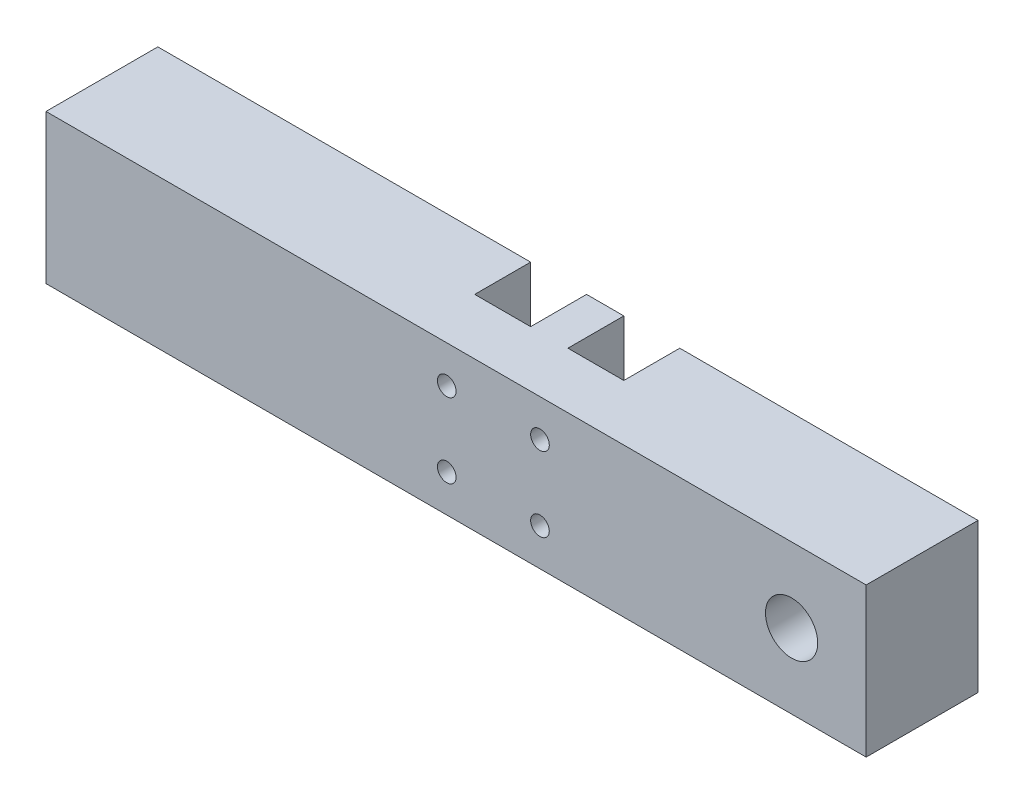
ISO-10303-21;
HEADER;
FILE_DESCRIPTION(('STEP AP214'),'2;1');
FILE_NAME('part.step','',(''),(''),'','','');
FILE_SCHEMA(('AUTOMOTIVE_DESIGN { 1 0 10303 214 1 1 1 1 }'));
ENDSEC;
DATA;
#1=APPLICATION_CONTEXT('core data for automotive mechanical design processes');
#2=APPLICATION_PROTOCOL_DEFINITION('international standard','automotive_design',2000,#1);
#3=PRODUCT_CONTEXT('',#1,'mechanical');
#4=PRODUCT('Part','Part','',(#3));
#5=PRODUCT_RELATED_PRODUCT_CATEGORY('part','',(#4));
#6=PRODUCT_DEFINITION_FORMATION('','',#4);
#7=PRODUCT_DEFINITION_CONTEXT('part definition',#1,'design');
#8=PRODUCT_DEFINITION('design','',#6,#7);
#9=PRODUCT_DEFINITION_SHAPE('','',#8);
#10=(LENGTH_UNIT() NAMED_UNIT(*) SI_UNIT(.MILLI.,.METRE.));
#11=(NAMED_UNIT(*) PLANE_ANGLE_UNIT() SI_UNIT($,.RADIAN.));
#12=(NAMED_UNIT(*) SI_UNIT($,.STERADIAN.) SOLID_ANGLE_UNIT());
#13=UNCERTAINTY_MEASURE_WITH_UNIT(LENGTH_MEASURE(1.E-05),#10,'distance_accuracy_value','');
#14=(GEOMETRIC_REPRESENTATION_CONTEXT(3) GLOBAL_UNCERTAINTY_ASSIGNED_CONTEXT((#13)) GLOBAL_UNIT_ASSIGNED_CONTEXT((#10,
#11,#12)) REPRESENTATION_CONTEXT('',''));
#15=CARTESIAN_POINT('',(0.,0.,0.));
#16=DIRECTION('',(0.,0.,1.));
#17=DIRECTION('',(1.,0.,0.));
#18=AXIS2_PLACEMENT_3D('',#15,#16,#17);
#19=CARTESIAN_POINT('',(0.,0.,0.));
#20=DIRECTION('',(0.,0.,1.));
#21=DIRECTION('',(1.,0.,0.));
#22=AXIS2_PLACEMENT_3D('',#19,#20,#21);
#23=PLANE('',#22);
#24=DIRECTION('',(-1.,0.,0.));
#25=VECTOR('',#24,1.);
#26=CARTESIAN_POINT('',(-110.,20.,0.));
#27=LINE('',#26,#25);
#28=CARTESIAN_POINT('',(-9.99999999999999,20.,0.));
#29=VERTEX_POINT('',#28);
#30=CARTESIAN_POINT('',(-110.,20.,0.));
#31=VERTEX_POINT('',#30);
#32=EDGE_CURVE('E200',#29,#31,#27,.T.);
#33=ORIENTED_EDGE('',*,*,#32,.F.);
#34=DIRECTION('',(0.,1.,0.));
#35=VECTOR('',#34,1.);
#36=CARTESIAN_POINT('',(-9.99999999999999,20.,0.));
#37=LINE('',#36,#35);
#38=CARTESIAN_POINT('',(-9.99999999999999,-20.,0.));
#39=VERTEX_POINT('',#38);
#40=EDGE_CURVE('E140',#39,#29,#37,.T.);
#41=ORIENTED_EDGE('',*,*,#40,.F.);
#42=DIRECTION('',(1.,0.,0.));
#43=VECTOR('',#42,1.);
#44=CARTESIAN_POINT('',(-110.,-20.,0.));
#45=LINE('',#44,#43);
#46=CARTESIAN_POINT('',(-110.,-20.,0.));
#47=VERTEX_POINT('',#46);
#48=EDGE_CURVE('E191',#47,#39,#45,.T.);
#49=ORIENTED_EDGE('',*,*,#48,.F.);
#50=DIRECTION('',(0.,-1.,0.));
#51=VECTOR('',#50,1.);
#52=CARTESIAN_POINT('',(-110.,20.,0.));
#53=LINE('',#52,#51);
#54=EDGE_CURVE('E204',#31,#47,#53,.T.);
#55=ORIENTED_EDGE('',*,*,#54,.F.);
#56=EDGE_LOOP('',(#33,#41,#49,#55));
#57=FACE_BOUND('',#56,.T.);
#58=ADVANCED_FACE('F33',(#57),#23,.F.);
#59=CARTESIAN_POINT('',(90.,0.,0.));
#60=DIRECTION('',(0.,0.,1.));
#61=DIRECTION('',(1.,0.,0.));
#62=AXIS2_PLACEMENT_3D('',#59,#60,#61);
#63=CIRCLE('',#62,9.99999999999999);
#64=CARTESIAN_POINT('',(100.,0.,0.));
#65=VERTEX_POINT('',#64);
#66=EDGE_CURVE('E184',#65,#65,#63,.T.);
#67=ORIENTED_EDGE('',*,*,#66,.T.);
#68=EDGE_LOOP('',(#67));
#69=FACE_BOUND('',#68,.T.);
#70=CARTESIAN_POINT('',(30.,-20.,0.));
#71=VERTEX_POINT('',#70);
#72=CARTESIAN_POINT('',(110.,-20.,0.));
#73=VERTEX_POINT('',#72);
#74=EDGE_CURVE('E206',#71,#73,#45,.T.);
#75=ORIENTED_EDGE('',*,*,#74,.F.);
#76=DIRECTION('',(0.,-1.,0.));
#77=VECTOR('',#76,1.);
#78=CARTESIAN_POINT('',(30.,20.,0.));
#79=LINE('',#78,#77);
#80=CARTESIAN_POINT('',(30.,20.,0.));
#81=VERTEX_POINT('',#80);
#82=EDGE_CURVE('E163',#81,#71,#79,.T.);
#83=ORIENTED_EDGE('',*,*,#82,.F.);
#84=CARTESIAN_POINT('',(110.,20.,0.));
#85=VERTEX_POINT('',#84);
#86=EDGE_CURVE('E201',#85,#81,#27,.T.);
#87=ORIENTED_EDGE('',*,*,#86,.F.);
#88=DIRECTION('',(0.,1.,0.));
#89=VECTOR('',#88,1.);
#90=CARTESIAN_POINT('',(110.,20.,0.));
#91=LINE('',#90,#89);
#92=EDGE_CURVE('E183',#73,#85,#91,.T.);
#93=ORIENTED_EDGE('',*,*,#92,.F.);
#94=EDGE_LOOP('',(#75,#83,#87,#93));
#95=FACE_BOUND('',#94,.T.);
#96=ADVANCED_FACE('F272',(#69,#95),#23,.F.);
#97=CARTESIAN_POINT('',(5.,-20.,0.));
#98=VERTEX_POINT('',#97);
#99=CARTESIAN_POINT('',(15.,-20.,0.));
#100=VERTEX_POINT('',#99);
#101=EDGE_CURVE('E209',#98,#100,#45,.T.);
#102=ORIENTED_EDGE('',*,*,#101,.F.);
#103=DIRECTION('',(0.,-1.,0.));
#104=VECTOR('',#103,1.);
#105=CARTESIAN_POINT('',(5.,20.,0.));
#106=LINE('',#105,#104);
#107=CARTESIAN_POINT('',(5.,20.,0.));
#108=VERTEX_POINT('',#107);
#109=EDGE_CURVE('E222',#108,#98,#106,.T.);
#110=ORIENTED_EDGE('',*,*,#109,.F.);
#111=CARTESIAN_POINT('',(15.,20.,0.));
#112=VERTEX_POINT('',#111);
#113=EDGE_CURVE('E146',#112,#108,#27,.T.);
#114=ORIENTED_EDGE('',*,*,#113,.F.);
#115=DIRECTION('',(0.,1.,0.));
#116=VECTOR('',#115,1.);
#117=CARTESIAN_POINT('',(15.,20.,0.));
#118=LINE('',#117,#116);
#119=EDGE_CURVE('E155',#100,#112,#118,.T.);
#120=ORIENTED_EDGE('',*,*,#119,.F.);
#121=EDGE_LOOP('',(#102,#110,#114,#120));
#122=FACE_BOUND('',#121,.T.);
#123=ADVANCED_FACE('F286',(#122),#23,.F.);
#124=CARTESIAN_POINT('',(110.,20.,30.));
#125=DIRECTION('',(-1.,0.,0.));
#126=DIRECTION('',(0.,0.,1.));
#127=AXIS2_PLACEMENT_3D('',#124,#125,#126);
#128=PLANE('',#127);
#129=ORIENTED_EDGE('',*,*,#92,.T.);
#130=DIRECTION('',(0.,0.,-1.));
#131=VECTOR('',#130,1.);
#132=CARTESIAN_POINT('',(110.,20.,30.));
#133=LINE('',#132,#131);
#134=CARTESIAN_POINT('',(110.,20.,30.));
#135=VERTEX_POINT('',#134);
#136=EDGE_CURVE('E11',#135,#85,#133,.T.);
#137=ORIENTED_EDGE('',*,*,#136,.F.);
#138=DIRECTION('',(0.,1.,0.));
#139=VECTOR('',#138,1.);
#140=CARTESIAN_POINT('',(110.,20.,30.));
#141=LINE('',#140,#139);
#142=CARTESIAN_POINT('',(110.,-20.,30.));
#143=VERTEX_POINT('',#142);
#144=EDGE_CURVE('E187',#143,#135,#141,.T.);
#145=ORIENTED_EDGE('',*,*,#144,.F.);
#146=DIRECTION('',(0.,0.,-1.));
#147=VECTOR('',#146,1.);
#148=CARTESIAN_POINT('',(110.,-20.,30.));
#149=LINE('',#148,#147);
#150=EDGE_CURVE('E197',#143,#73,#149,.T.);
#151=ORIENTED_EDGE('',*,*,#150,.T.);
#152=EDGE_LOOP('',(#129,#137,#145,#151));
#153=FACE_BOUND('',#152,.T.);
#154=ADVANCED_FACE('F35',(#153),#128,.F.);
#155=CARTESIAN_POINT('',(-110.,20.,30.));
#156=DIRECTION('',(0.,-1.,0.));
#157=DIRECTION('',(0.,0.,-1.));
#158=AXIS2_PLACEMENT_3D('',#155,#156,#157);
#159=PLANE('',#158);
#160=DIRECTION('',(1.,0.,0.));
#161=VECTOR('',#160,1.);
#162=CARTESIAN_POINT('',(-9.99999999999999,20.,15.));
#163=LINE('',#162,#161);
#164=CARTESIAN_POINT('',(-9.99999999999999,20.,15.));
#165=VERTEX_POINT('',#164);
#166=CARTESIAN_POINT('',(5.,20.,15.));
#167=VERTEX_POINT('',#166);
#168=EDGE_CURVE('E131',#165,#167,#163,.T.);
#169=ORIENTED_EDGE('',*,*,#168,.F.);
#170=DIRECTION('',(0.,0.,-1.));
#171=VECTOR('',#170,1.);
#172=CARTESIAN_POINT('',(-9.99999999999999,20.,15.));
#173=LINE('',#172,#171);
#174=EDGE_CURVE('E165',#165,#29,#173,.T.);
#175=ORIENTED_EDGE('',*,*,#174,.T.);
#176=ORIENTED_EDGE('',*,*,#32,.T.);
#177=DIRECTION('',(0.,0.,-1.));
#178=VECTOR('',#177,1.);
#179=CARTESIAN_POINT('',(-110.,20.,30.));
#180=LINE('',#179,#178);
#181=CARTESIAN_POINT('',(-110.,20.,30.));
#182=VERTEX_POINT('',#181);
#183=EDGE_CURVE('E42',#182,#31,#180,.T.);
#184=ORIENTED_EDGE('',*,*,#183,.F.);
#185=DIRECTION('',(-1.,0.,0.));
#186=VECTOR('',#185,1.);
#187=CARTESIAN_POINT('',(-110.,20.,30.));
#188=LINE('',#187,#186);
#189=EDGE_CURVE('E190',#135,#182,#188,.T.);
#190=ORIENTED_EDGE('',*,*,#189,.F.);
#191=ORIENTED_EDGE('',*,*,#136,.T.);
#192=ORIENTED_EDGE('',*,*,#86,.T.);
#193=DIRECTION('',(0.,0.,-1.));
#194=VECTOR('',#193,1.);
#195=CARTESIAN_POINT('',(30.,20.,15.));
#196=LINE('',#195,#194);
#197=CARTESIAN_POINT('',(30.,20.,15.));
#198=VERTEX_POINT('',#197);
#199=EDGE_CURVE('E167',#198,#81,#196,.T.);
#200=ORIENTED_EDGE('',*,*,#199,.F.);
#201=DIRECTION('',(1.,0.,0.));
#202=VECTOR('',#201,1.);
#203=CARTESIAN_POINT('',(30.,20.,15.));
#204=LINE('',#203,#202);
#205=CARTESIAN_POINT('',(15.,20.,15.));
#206=VERTEX_POINT('',#205);
#207=EDGE_CURVE('E160',#206,#198,#204,.T.);
#208=ORIENTED_EDGE('',*,*,#207,.F.);
#209=DIRECTION('',(0.,0.,-1.));
#210=VECTOR('',#209,1.);
#211=CARTESIAN_POINT('',(15.,20.,15.));
#212=LINE('',#211,#210);
#213=EDGE_CURVE('E170',#206,#112,#212,.T.);
#214=ORIENTED_EDGE('',*,*,#213,.T.);
#215=ORIENTED_EDGE('',*,*,#113,.T.);
#216=DIRECTION('',(0.,0.,-1.));
#217=VECTOR('',#216,1.);
#218=CARTESIAN_POINT('',(5.,20.,15.));
#219=LINE('',#218,#217);
#220=EDGE_CURVE('E125',#167,#108,#219,.T.);
#221=ORIENTED_EDGE('',*,*,#220,.F.);
#222=EDGE_LOOP('',(#169,#175,#176,#184,#190,#191,#192,#200,#208,#214,#215,#221));
#223=FACE_BOUND('',#222,.T.);
#224=ADVANCED_FACE('F143',(#223),#159,.F.);
#225=CARTESIAN_POINT('',(-110.,20.,30.));
#226=DIRECTION('',(1.,0.,0.));
#227=DIRECTION('',(0.,0.,-1.));
#228=AXIS2_PLACEMENT_3D('',#225,#226,#227);
#229=PLANE('',#228);
#230=ORIENTED_EDGE('',*,*,#54,.T.);
#231=DIRECTION('',(0.,0.,-1.));
#232=VECTOR('',#231,1.);
#233=CARTESIAN_POINT('',(-110.,-20.,30.));
#234=LINE('',#233,#232);
#235=CARTESIAN_POINT('',(-110.,-20.,30.));
#236=VERTEX_POINT('',#235);
#237=EDGE_CURVE('E212',#236,#47,#234,.T.);
#238=ORIENTED_EDGE('',*,*,#237,.F.);
#239=DIRECTION('',(0.,-1.,0.));
#240=VECTOR('',#239,1.);
#241=CARTESIAN_POINT('',(-110.,20.,30.));
#242=LINE('',#241,#240);
#243=EDGE_CURVE('E193',#182,#236,#242,.T.);
#244=ORIENTED_EDGE('',*,*,#243,.F.);
#245=ORIENTED_EDGE('',*,*,#183,.T.);
#246=EDGE_LOOP('',(#230,#238,#244,#245));
#247=FACE_BOUND('',#246,.T.);
#248=ADVANCED_FACE('F262',(#247),#229,.F.);
#249=CARTESIAN_POINT('',(-110.,-20.,30.));
#250=DIRECTION('',(0.,1.,0.));
#251=DIRECTION('',(0.,0.,1.));
#252=AXIS2_PLACEMENT_3D('',#249,#250,#251);
#253=PLANE('',#252);
#254=ORIENTED_EDGE('',*,*,#48,.T.);
#255=DIRECTION('',(0.,0.,-1.));
#256=VECTOR('',#255,1.);
#257=CARTESIAN_POINT('',(-9.99999999999999,-20.,15.));
#258=LINE('',#257,#256);
#259=CARTESIAN_POINT('',(-9.99999999999999,-20.,15.));
#260=VERTEX_POINT('',#259);
#261=EDGE_CURVE('E148',#260,#39,#258,.T.);
#262=ORIENTED_EDGE('',*,*,#261,.F.);
#263=DIRECTION('',(-1.,0.,0.));
#264=VECTOR('',#263,1.);
#265=CARTESIAN_POINT('',(-9.99999999999999,-20.,15.));
#266=LINE('',#265,#264);
#267=CARTESIAN_POINT('',(5.,-20.,15.));
#268=VERTEX_POINT('',#267);
#269=EDGE_CURVE('E130',#268,#260,#266,.T.);
#270=ORIENTED_EDGE('',*,*,#269,.F.);
#271=DIRECTION('',(0.,0.,-1.));
#272=VECTOR('',#271,1.);
#273=CARTESIAN_POINT('',(5.,-20.,15.));
#274=LINE('',#273,#272);
#275=EDGE_CURVE('E128',#268,#98,#274,.T.);
#276=ORIENTED_EDGE('',*,*,#275,.T.);
#277=ORIENTED_EDGE('',*,*,#101,.T.);
#278=DIRECTION('',(0.,0.,-1.));
#279=VECTOR('',#278,1.);
#280=CARTESIAN_POINT('',(15.,-20.,15.));
#281=LINE('',#280,#279);
#282=CARTESIAN_POINT('',(15.,-20.,15.));
#283=VERTEX_POINT('',#282);
#284=EDGE_CURVE('E172',#283,#100,#281,.T.);
#285=ORIENTED_EDGE('',*,*,#284,.F.);
#286=DIRECTION('',(-1.,0.,0.));
#287=VECTOR('',#286,1.);
#288=CARTESIAN_POINT('',(30.,-20.,15.));
#289=LINE('',#288,#287);
#290=CARTESIAN_POINT('',(30.,-20.,15.));
#291=VERTEX_POINT('',#290);
#292=EDGE_CURVE('E154',#291,#283,#289,.T.);
#293=ORIENTED_EDGE('',*,*,#292,.F.);
#294=DIRECTION('',(0.,0.,-1.));
#295=VECTOR('',#294,1.);
#296=CARTESIAN_POINT('',(30.,-20.,15.));
#297=LINE('',#296,#295);
#298=EDGE_CURVE('E162',#291,#71,#297,.T.);
#299=ORIENTED_EDGE('',*,*,#298,.T.);
#300=ORIENTED_EDGE('',*,*,#74,.T.);
#301=ORIENTED_EDGE('',*,*,#150,.F.);
#302=DIRECTION('',(1.,0.,0.));
#303=VECTOR('',#302,1.);
#304=CARTESIAN_POINT('',(-110.,-20.,30.));
#305=LINE('',#304,#303);
#306=EDGE_CURVE('E195',#236,#143,#305,.T.);
#307=ORIENTED_EDGE('',*,*,#306,.F.);
#308=ORIENTED_EDGE('',*,*,#237,.T.);
#309=EDGE_LOOP('',(#254,#262,#270,#276,#277,#285,#293,#299,#300,#301,#307,#308));
#310=FACE_BOUND('',#309,.T.);
#311=ADVANCED_FACE('F256',(#310),#253,.F.);
#312=CARTESIAN_POINT('',(0.,0.,30.));
#313=DIRECTION('',(0.,0.,1.));
#314=DIRECTION('',(1.,0.,0.));
#315=AXIS2_PLACEMENT_3D('',#312,#313,#314);
#316=PLANE('',#315);
#317=CARTESIAN_POINT('',(-2.5,10.,30.));
#318=DIRECTION('',(0.,0.,-1.));
#319=DIRECTION('',(1.,0.,0.));
#320=AXIS2_PLACEMENT_3D('',#317,#318,#319);
#321=CIRCLE('',#320,2.5);
#322=CARTESIAN_POINT('',(0.,10.,30.));
#323=VERTEX_POINT('',#322);
#324=EDGE_CURVE('E239',#323,#323,#321,.T.);
#325=ORIENTED_EDGE('',*,*,#324,.T.);
#326=EDGE_LOOP('',(#325));
#327=FACE_BOUND('',#326,.T.);
#328=CARTESIAN_POINT('',(-2.5,-10.,30.));
#329=DIRECTION('',(0.,0.,-1.));
#330=DIRECTION('',(-1.,0.,0.));
#331=AXIS2_PLACEMENT_3D('',#328,#329,#330);
#332=CIRCLE('',#331,2.5);
#333=CARTESIAN_POINT('',(-4.99999999999999,-10.,30.));
#334=VERTEX_POINT('',#333);
#335=EDGE_CURVE('E229',#334,#334,#332,.T.);
#336=ORIENTED_EDGE('',*,*,#335,.T.);
#337=EDGE_LOOP('',(#336));
#338=FACE_BOUND('',#337,.T.);
#339=CARTESIAN_POINT('',(22.5,-10.,30.));
#340=DIRECTION('',(0.,0.,-1.));
#341=DIRECTION('',(1.,0.,0.));
#342=AXIS2_PLACEMENT_3D('',#339,#340,#341);
#343=CIRCLE('',#342,2.5);
#344=CARTESIAN_POINT('',(25.,-10.,30.));
#345=VERTEX_POINT('',#344);
#346=EDGE_CURVE('E226',#345,#345,#343,.T.);
#347=ORIENTED_EDGE('',*,*,#346,.T.);
#348=EDGE_LOOP('',(#347));
#349=FACE_BOUND('',#348,.T.);
#350=CARTESIAN_POINT('',(22.5,10.,30.));
#351=DIRECTION('',(0.,0.,-1.));
#352=DIRECTION('',(-1.,0.,0.));
#353=AXIS2_PLACEMENT_3D('',#350,#351,#352);
#354=CIRCLE('',#353,2.5);
#355=CARTESIAN_POINT('',(20.,10.,30.));
#356=VERTEX_POINT('',#355);
#357=EDGE_CURVE('E223',#356,#356,#354,.T.);
#358=ORIENTED_EDGE('',*,*,#357,.T.);
#359=EDGE_LOOP('',(#358));
#360=FACE_BOUND('',#359,.T.);
#361=CARTESIAN_POINT('',(90.,0.,30.));
#362=DIRECTION('',(0.,0.,-1.));
#363=DIRECTION('',(-1.,0.,0.));
#364=AXIS2_PLACEMENT_3D('',#361,#362,#363);
#365=CIRCLE('',#364,7.);
#366=CARTESIAN_POINT('',(83.,0.,30.));
#367=VERTEX_POINT('',#366);
#368=EDGE_CURVE('E169',#367,#367,#365,.T.);
#369=ORIENTED_EDGE('',*,*,#368,.T.);
#370=EDGE_LOOP('',(#369));
#371=FACE_BOUND('',#370,.T.);
#372=ORIENTED_EDGE('',*,*,#144,.T.);
#373=ORIENTED_EDGE('',*,*,#189,.T.);
#374=ORIENTED_EDGE('',*,*,#243,.T.);
#375=ORIENTED_EDGE('',*,*,#306,.T.);
#376=EDGE_LOOP('',(#372,#373,#374,#375));
#377=FACE_BOUND('',#376,.T.);
#378=ADVANCED_FACE('F267',(#327,#338,#349,#360,#371,#377),#316,.T.);
#379=CARTESIAN_POINT('',(90.,0.,7.));
#380=DIRECTION('',(0.,0.,-1.));
#381=DIRECTION('',(-1.,0.,0.));
#382=AXIS2_PLACEMENT_3D('',#379,#380,#381);
#383=CYLINDRICAL_SURFACE('',#382,9.99999999999999);
#384=CARTESIAN_POINT('',(90.,0.,7.));
#385=DIRECTION('',(0.,0.,1.));
#386=DIRECTION('',(1.,0.,0.));
#387=AXIS2_PLACEMENT_3D('',#384,#385,#386);
#388=CIRCLE('',#387,9.99999999999999);
#389=CARTESIAN_POINT('',(100.,0.,7.));
#390=VERTEX_POINT('',#389);
#391=EDGE_CURVE('E180',#390,#390,#388,.T.);
#392=ORIENTED_EDGE('',*,*,#391,.T.);
#393=EDGE_LOOP('',(#392));
#394=FACE_BOUND('',#393,.T.);
#395=ORIENTED_EDGE('',*,*,#66,.F.);
#396=EDGE_LOOP('',(#395));
#397=FACE_BOUND('',#396,.T.);
#398=ADVANCED_FACE('F374',(#394,#397),#383,.F.);
#399=CARTESIAN_POINT('',(90.,0.,7.));
#400=DIRECTION('',(0.,0.,1.));
#401=DIRECTION('',(1.,0.,0.));
#402=AXIS2_PLACEMENT_3D('',#399,#400,#401);
#403=PLANE('',#402);
#404=CARTESIAN_POINT('',(90.,0.,7.));
#405=DIRECTION('',(0.,0.,1.));
#406=DIRECTION('',(1.,0.,0.));
#407=AXIS2_PLACEMENT_3D('',#404,#405,#406);
#408=CIRCLE('',#407,7.);
#409=CARTESIAN_POINT('',(97.,0.,7.));
#410=VERTEX_POINT('',#409);
#411=EDGE_CURVE('E179',#410,#410,#408,.T.);
#412=ORIENTED_EDGE('',*,*,#411,.T.);
#413=EDGE_LOOP('',(#412));
#414=FACE_BOUND('',#413,.T.);
#415=ORIENTED_EDGE('',*,*,#391,.F.);
#416=EDGE_LOOP('',(#415));
#417=FACE_BOUND('',#416,.T.);
#418=ADVANCED_FACE('F435',(#414,#417),#403,.F.);
#419=CARTESIAN_POINT('',(90.,0.,30.));
#420=DIRECTION('',(0.,0.,-1.));
#421=DIRECTION('',(-1.,0.,0.));
#422=AXIS2_PLACEMENT_3D('',#419,#420,#421);
#423=CYLINDRICAL_SURFACE('',#422,7.);
#424=ORIENTED_EDGE('',*,*,#368,.F.);
#425=EDGE_LOOP('',(#424));
#426=FACE_BOUND('',#425,.T.);
#427=ORIENTED_EDGE('',*,*,#411,.F.);
#428=EDGE_LOOP('',(#427));
#429=FACE_BOUND('',#428,.T.);
#430=ADVANCED_FACE('F338',(#426,#429),#423,.F.);
#431=CARTESIAN_POINT('',(30.,20.,15.));
#432=DIRECTION('',(1.,0.,0.));
#433=DIRECTION('',(0.,1.,0.));
#434=AXIS2_PLACEMENT_3D('',#431,#432,#433);
#435=PLANE('',#434);
#436=ORIENTED_EDGE('',*,*,#82,.T.);
#437=ORIENTED_EDGE('',*,*,#298,.F.);
#438=DIRECTION('',(0.,-1.,0.));
#439=VECTOR('',#438,1.);
#440=CARTESIAN_POINT('',(30.,20.,15.));
#441=LINE('',#440,#439);
#442=EDGE_CURVE('E58',#198,#291,#441,.T.);
#443=ORIENTED_EDGE('',*,*,#442,.F.);
#444=ORIENTED_EDGE('',*,*,#199,.T.);
#445=EDGE_LOOP('',(#436,#437,#443,#444));
#446=FACE_BOUND('',#445,.T.);
#447=ADVANCED_FACE('F277',(#446),#435,.F.);
#448=CARTESIAN_POINT('',(15.,20.,15.));
#449=DIRECTION('',(-1.,0.,0.));
#450=DIRECTION('',(0.,0.,1.));
#451=AXIS2_PLACEMENT_3D('',#448,#449,#450);
#452=PLANE('',#451);
#453=ORIENTED_EDGE('',*,*,#119,.T.);
#454=ORIENTED_EDGE('',*,*,#213,.F.);
#455=DIRECTION('',(0.,1.,0.));
#456=VECTOR('',#455,1.);
#457=CARTESIAN_POINT('',(15.,20.,15.));
#458=LINE('',#457,#456);
#459=EDGE_CURVE('E157',#283,#206,#458,.T.);
#460=ORIENTED_EDGE('',*,*,#459,.F.);
#461=ORIENTED_EDGE('',*,*,#284,.T.);
#462=EDGE_LOOP('',(#453,#454,#460,#461));
#463=FACE_BOUND('',#462,.T.);
#464=ADVANCED_FACE('F282',(#463),#452,.F.);
#465=CARTESIAN_POINT('',(0.,0.,15.));
#466=DIRECTION('',(0.,0.,-1.));
#467=DIRECTION('',(-1.,0.,0.));
#468=AXIS2_PLACEMENT_3D('',#465,#466,#467);
#469=PLANE('',#468);
#470=CARTESIAN_POINT('',(22.5,-10.,15.));
#471=DIRECTION('',(0.,0.,-1.));
#472=DIRECTION('',(-1.,0.,0.));
#473=AXIS2_PLACEMENT_3D('',#470,#471,#472);
#474=CIRCLE('',#473,2.5);
#475=CARTESIAN_POINT('',(20.,-10.,15.));
#476=VERTEX_POINT('',#475);
#477=EDGE_CURVE('E224',#476,#476,#474,.T.);
#478=ORIENTED_EDGE('',*,*,#477,.F.);
#479=EDGE_LOOP('',(#478));
#480=FACE_BOUND('',#479,.T.);
#481=CARTESIAN_POINT('',(22.5,10.,15.));
#482=DIRECTION('',(0.,0.,-1.));
#483=DIRECTION('',(-1.,0.,0.));
#484=AXIS2_PLACEMENT_3D('',#481,#482,#483);
#485=CIRCLE('',#484,2.5);
#486=CARTESIAN_POINT('',(20.,10.,15.));
#487=VERTEX_POINT('',#486);
#488=EDGE_CURVE('E219',#487,#487,#485,.T.);
#489=ORIENTED_EDGE('',*,*,#488,.F.);
#490=EDGE_LOOP('',(#489));
#491=FACE_BOUND('',#490,.T.);
#492=ORIENTED_EDGE('',*,*,#442,.T.);
#493=ORIENTED_EDGE('',*,*,#292,.T.);
#494=ORIENTED_EDGE('',*,*,#459,.T.);
#495=ORIENTED_EDGE('',*,*,#207,.T.);
#496=EDGE_LOOP('',(#492,#493,#494,#495));
#497=FACE_BOUND('',#496,.T.);
#498=ADVANCED_FACE('F279',(#480,#491,#497),#469,.T.);
#499=CARTESIAN_POINT('',(-9.99999999999999,20.,15.));
#500=DIRECTION('',(-1.,0.,0.));
#501=DIRECTION('',(0.,-1.,0.));
#502=AXIS2_PLACEMENT_3D('',#499,#500,#501);
#503=PLANE('',#502);
#504=ORIENTED_EDGE('',*,*,#40,.T.);
#505=ORIENTED_EDGE('',*,*,#174,.F.);
#506=DIRECTION('',(0.,1.,0.));
#507=VECTOR('',#506,1.);
#508=CARTESIAN_POINT('',(-9.99999999999999,20.,15.));
#509=LINE('',#508,#507);
#510=EDGE_CURVE('E137',#260,#165,#509,.T.);
#511=ORIENTED_EDGE('',*,*,#510,.F.);
#512=ORIENTED_EDGE('',*,*,#261,.T.);
#513=EDGE_LOOP('',(#504,#505,#511,#512));
#514=FACE_BOUND('',#513,.T.);
#515=ADVANCED_FACE('F250',(#514),#503,.F.);
#516=CARTESIAN_POINT('',(5.,20.,15.));
#517=DIRECTION('',(1.,0.,0.));
#518=DIRECTION('',(0.,0.,-1.));
#519=AXIS2_PLACEMENT_3D('',#516,#517,#518);
#520=PLANE('',#519);
#521=ORIENTED_EDGE('',*,*,#109,.T.);
#522=ORIENTED_EDGE('',*,*,#275,.F.);
#523=DIRECTION('',(0.,-1.,0.));
#524=VECTOR('',#523,1.);
#525=CARTESIAN_POINT('',(5.,20.,15.));
#526=LINE('',#525,#524);
#527=EDGE_CURVE('E50',#167,#268,#526,.T.);
#528=ORIENTED_EDGE('',*,*,#527,.F.);
#529=ORIENTED_EDGE('',*,*,#220,.T.);
#530=EDGE_LOOP('',(#521,#522,#528,#529));
#531=FACE_BOUND('',#530,.T.);
#532=ADVANCED_FACE('F123',(#531),#520,.F.);
#533=CARTESIAN_POINT('',(0.,0.,15.));
#534=DIRECTION('',(0.,0.,-1.));
#535=DIRECTION('',(-1.,0.,0.));
#536=AXIS2_PLACEMENT_3D('',#533,#534,#535);
#537=PLANE('',#536);
#538=CARTESIAN_POINT('',(-2.5,10.,15.));
#539=DIRECTION('',(0.,0.,-1.));
#540=DIRECTION('',(-1.,0.,0.));
#541=AXIS2_PLACEMENT_3D('',#538,#539,#540);
#542=CIRCLE('',#541,2.5);
#543=CARTESIAN_POINT('',(-4.99999999999999,10.,15.));
#544=VERTEX_POINT('',#543);
#545=EDGE_CURVE('E37',#544,#544,#542,.T.);
#546=ORIENTED_EDGE('',*,*,#545,.F.);
#547=EDGE_LOOP('',(#546));
#548=FACE_BOUND('',#547,.T.);
#549=CARTESIAN_POINT('',(-2.5,-10.,15.));
#550=DIRECTION('',(0.,0.,-1.));
#551=DIRECTION('',(-1.,0.,0.));
#552=AXIS2_PLACEMENT_3D('',#549,#550,#551);
#553=CIRCLE('',#552,2.5);
#554=CARTESIAN_POINT('',(-4.99999999999999,-10.,15.));
#555=VERTEX_POINT('',#554);
#556=EDGE_CURVE('E227',#555,#555,#553,.T.);
#557=ORIENTED_EDGE('',*,*,#556,.F.);
#558=EDGE_LOOP('',(#557));
#559=FACE_BOUND('',#558,.T.);
#560=ORIENTED_EDGE('',*,*,#168,.T.);
#561=ORIENTED_EDGE('',*,*,#527,.T.);
#562=ORIENTED_EDGE('',*,*,#269,.T.);
#563=ORIENTED_EDGE('',*,*,#510,.T.);
#564=EDGE_LOOP('',(#560,#561,#562,#563));
#565=FACE_BOUND('',#564,.T.);
#566=ADVANCED_FACE('F135',(#548,#559,#565),#537,.T.);
#567=CARTESIAN_POINT('',(22.5,10.,30.));
#568=DIRECTION('',(0.,0.,-1.));
#569=DIRECTION('',(-1.,0.,0.));
#570=AXIS2_PLACEMENT_3D('',#567,#568,#569);
#571=CYLINDRICAL_SURFACE('',#570,2.5);
#572=ORIENTED_EDGE('',*,*,#488,.T.);
#573=EDGE_LOOP('',(#572));
#574=FACE_BOUND('',#573,.T.);
#575=ORIENTED_EDGE('',*,*,#357,.F.);
#576=EDGE_LOOP('',(#575));
#577=FACE_BOUND('',#576,.T.);
#578=ADVANCED_FACE('F389',(#574,#577),#571,.F.);
#579=CARTESIAN_POINT('',(22.5,-10.,30.));
#580=DIRECTION('',(0.,0.,-1.));
#581=DIRECTION('',(-1.,0.,0.));
#582=AXIS2_PLACEMENT_3D('',#579,#580,#581);
#583=CYLINDRICAL_SURFACE('',#582,2.5);
#584=ORIENTED_EDGE('',*,*,#477,.T.);
#585=EDGE_LOOP('',(#584));
#586=FACE_BOUND('',#585,.T.);
#587=ORIENTED_EDGE('',*,*,#346,.F.);
#588=EDGE_LOOP('',(#587));
#589=FACE_BOUND('',#588,.T.);
#590=ADVANCED_FACE('F399',(#586,#589),#583,.F.);
#591=CARTESIAN_POINT('',(-2.5,-10.,30.));
#592=DIRECTION('',(0.,0.,-1.));
#593=DIRECTION('',(-1.,0.,0.));
#594=AXIS2_PLACEMENT_3D('',#591,#592,#593);
#595=CYLINDRICAL_SURFACE('',#594,2.5);
#596=ORIENTED_EDGE('',*,*,#556,.T.);
#597=EDGE_LOOP('',(#596));
#598=FACE_BOUND('',#597,.T.);
#599=ORIENTED_EDGE('',*,*,#335,.F.);
#600=EDGE_LOOP('',(#599));
#601=FACE_BOUND('',#600,.T.);
#602=ADVANCED_FACE('F409',(#598,#601),#595,.F.);
#603=CARTESIAN_POINT('',(-2.5,10.,30.));
#604=DIRECTION('',(0.,0.,-1.));
#605=DIRECTION('',(-1.,0.,0.));
#606=AXIS2_PLACEMENT_3D('',#603,#604,#605);
#607=CYLINDRICAL_SURFACE('',#606,2.5);
#608=ORIENTED_EDGE('',*,*,#545,.T.);
#609=EDGE_LOOP('',(#608));
#610=FACE_BOUND('',#609,.T.);
#611=ORIENTED_EDGE('',*,*,#324,.F.);
#612=EDGE_LOOP('',(#611));
#613=FACE_BOUND('',#612,.T.);
#614=ADVANCED_FACE('F419',(#610,#613),#607,.F.);
#615=CLOSED_SHELL('',(#58,#96,#123,#154,#224,#248,#311,#378,#398,#418,#430,#447,#464,#498,#515,
#532,#566,#578,#590,#602,#614));
#616=MANIFOLD_SOLID_BREP('B2',#615);
#617=ADVANCED_BREP_SHAPE_REPRESENTATION('',(#18,#616),#14);
#618=SHAPE_DEFINITION_REPRESENTATION(#9,#617);
ENDSEC;
END-ISO-10303-21;
